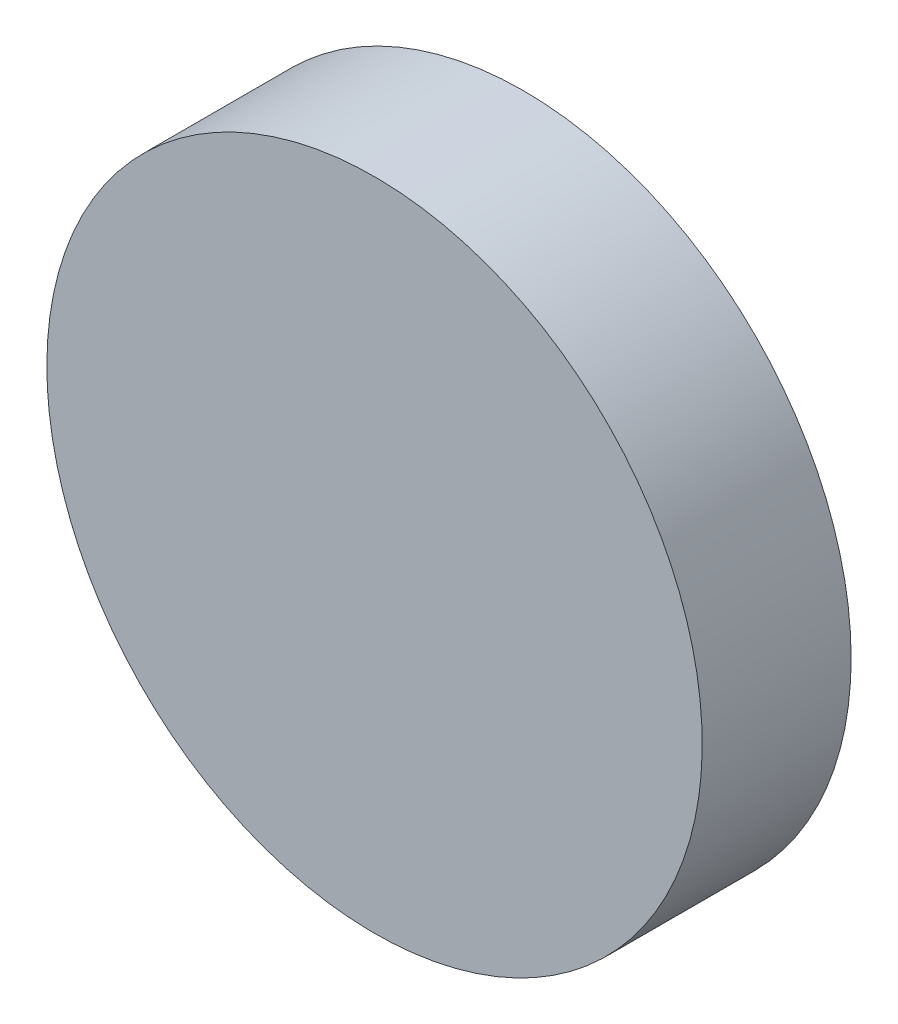
ISO-10303-21;
HEADER;
FILE_DESCRIPTION(('STEP AP214'),'2;1');
FILE_NAME('part.step','',(''),(''),'','','');
FILE_SCHEMA(('AUTOMOTIVE_DESIGN { 1 0 10303 214 1 1 1 1 }'));
ENDSEC;
DATA;
#1=APPLICATION_CONTEXT('core data for automotive mechanical design processes');
#2=APPLICATION_PROTOCOL_DEFINITION('international standard','automotive_design',2000,#1);
#3=PRODUCT_CONTEXT('',#1,'mechanical');
#4=PRODUCT('Part','Part','',(#3));
#5=PRODUCT_RELATED_PRODUCT_CATEGORY('part','',(#4));
#6=PRODUCT_DEFINITION_FORMATION('','',#4);
#7=PRODUCT_DEFINITION_CONTEXT('part definition',#1,'design');
#8=PRODUCT_DEFINITION('design','',#6,#7);
#9=PRODUCT_DEFINITION_SHAPE('','',#8);
#10=(LENGTH_UNIT() NAMED_UNIT(*) SI_UNIT(.MILLI.,.METRE.));
#11=(NAMED_UNIT(*) PLANE_ANGLE_UNIT() SI_UNIT($,.RADIAN.));
#12=(NAMED_UNIT(*) SI_UNIT($,.STERADIAN.) SOLID_ANGLE_UNIT());
#13=UNCERTAINTY_MEASURE_WITH_UNIT(LENGTH_MEASURE(1.E-05),#10,'distance_accuracy_value','');
#14=(GEOMETRIC_REPRESENTATION_CONTEXT(3) GLOBAL_UNCERTAINTY_ASSIGNED_CONTEXT((#13)) GLOBAL_UNIT_ASSIGNED_CONTEXT((#10,
#11,#12)) REPRESENTATION_CONTEXT('',''));
#15=CARTESIAN_POINT('',(0.,0.,0.));
#16=DIRECTION('',(0.,0.,1.));
#17=DIRECTION('',(1.,0.,0.));
#18=AXIS2_PLACEMENT_3D('',#15,#16,#17);
#19=CARTESIAN_POINT('',(-26.0710674761699,-4.71707895126206,257.4992));
#20=CARTESIAN_POINT('',(-26.0710674761699,-3.99696507585602,257.4992));
#21=CARTESIAN_POINT('',(-25.9292174238385,-2.55673732504394,257.4992));
#22=CARTESIAN_POINT('',(-25.2990690152882,-0.479416415987846,257.4992));
#23=CARTESIAN_POINT('',(-24.2757635266339,1.43505349834619,257.4992));
#24=CARTESIAN_POINT('',(-22.8986260139283,3.11310041279741,257.4992));
#25=CARTESIAN_POINT('',(-21.2205790994771,4.490237925503,257.4992));
#26=CARTESIAN_POINT('',(-19.306109185143,5.5135434141573,257.4992));
#27=CARTESIAN_POINT('',(-17.2287882760869,6.14369182270765,257.4992));
#28=CARTESIAN_POINT('',(-15.0684466498688,6.35646690120477,257.4992));
#29=CARTESIAN_POINT('',(-12.9081050236507,6.14369182270765,257.4992));
#30=CARTESIAN_POINT('',(-10.8307841145946,5.5135434141573,257.4992));
#31=CARTESIAN_POINT('',(-8.91631420026057,4.490237925503,257.4992));
#32=CARTESIAN_POINT('',(-7.23826728580934,3.11310041279741,257.4992));
#33=CARTESIAN_POINT('',(-5.86112977310376,1.43505349834619,257.4992));
#34=CARTESIAN_POINT('',(-4.83782428444946,-0.479416415987844,257.4992));
#35=CARTESIAN_POINT('',(-4.20767587589911,-2.55673732504394,257.4992));
#36=CARTESIAN_POINT('',(-3.99490079740198,-4.71707895126205,257.4992));
#37=CARTESIAN_POINT('',(-4.20767587589911,-6.87742057748017,257.4992));
#38=CARTESIAN_POINT('',(-4.83782428444946,-8.95474148653627,257.4992));
#39=CARTESIAN_POINT('',(-5.86112977310376,-10.8692114008703,257.4992));
#40=CARTESIAN_POINT('',(-7.23826728580935,-12.5472583153215,257.4992));
#41=CARTESIAN_POINT('',(-8.91631420026057,-13.9243958280271,257.4992));
#42=CARTESIAN_POINT('',(-10.8307841145946,-14.9477013166814,257.4992));
#43=CARTESIAN_POINT('',(-12.9081050236507,-15.5778497252318,257.4992));
#44=CARTESIAN_POINT('',(-15.0684466498688,-15.7906248037289,257.4992));
#45=CARTESIAN_POINT('',(-17.2287882760869,-15.5778497252318,257.4992));
#46=CARTESIAN_POINT('',(-19.306109185143,-14.9477013166814,257.4992));
#47=CARTESIAN_POINT('',(-21.2205790994771,-13.9243958280271,257.4992));
#48=CARTESIAN_POINT('',(-22.8986260139283,-12.5472583153215,257.4992));
#49=CARTESIAN_POINT('',(-24.2757635266339,-10.8692114008703,257.4992));
#50=CARTESIAN_POINT('',(-25.2990690152882,-8.95474148653627,257.4992));
#51=CARTESIAN_POINT('',(-25.9292174238385,-6.87742057748017,257.4992));
#52=CARTESIAN_POINT('',(-26.0710674761699,-5.43719282666809,257.4992));
#53=CARTESIAN_POINT('',(-26.0710674761699,-4.71707895126206,257.4992));
#54=B_SPLINE_CURVE_WITH_KNOTS('',3,(#19,#20,#21,#22,#23,#24,#25,#26,#27,#28,#29,#30,#31,#32,#33,
#34,#35,#36,#37,#38,#39,#40,#41,#42,#43,#44,#45,#46,#47,#48,#49,#50,#51,#52,#53),.UNSPECIFIED.,
.T.,.F.,(4,1,1,1,1,1,1,1,1,1,1,1,1,1,1,1,1,1,1,1,1,1,1,1,1,1,1,1,1,1,1,1,4),(0.,0.03125,0.0625,
0.09375,0.125,0.15625,0.1875,0.21875,0.25,0.28125,0.3125,0.34375,0.375,0.40625,0.4375,0.46875,
0.5,0.53125,0.5625,0.59375,0.625,0.65625,0.6875,0.71875,0.75,0.78125,0.8125,0.84375,0.875,
0.90625,0.9375,0.96875,1.),.UNSPECIFIED.);
#55=DIRECTION('',(0.,0.,1.));
#56=VECTOR('',#55,1.);
#57=SURFACE_OF_LINEAR_EXTRUSION('',#54,#56);
#58=CARTESIAN_POINT('',(-26.0710674761699,-4.71707895126206,257.4992));
#59=CARTESIAN_POINT('',(-26.0710674388279,-4.8971085255535,257.4992));
#60=CARTESIAN_POINT('',(-26.0666346090958,-5.0771367896126,257.4992));
#61=CARTESIAN_POINT('',(-26.0489459773709,-5.43676092320657,257.4992));
#62=CARTESIAN_POINT('',(-26.0356901068426,-5.61635678937178,257.4992));
#63=CARTESIAN_POINT('',(-26.0003980073713,-5.97468354282203,257.4992));
#64=CARTESIAN_POINT('',(-25.9783617784283,-6.15341443010706,257.4992));
#65=CARTESIAN_POINT('',(-25.9255512820031,-6.50957974007257,257.4992));
#66=CARTESIAN_POINT('',(-25.8947770823977,-6.68701417281297,257.4992));
#67=CARTESIAN_POINT('',(-25.8245333219282,-7.04015340976002,257.4992));
#68=CARTESIAN_POINT('',(-25.7850637610641,-7.21585821396667,257.4992));
#69=CARTESIAN_POINT('',(-25.6975557247985,-7.56512178142148,257.4992));
#70=CARTESIAN_POINT('',(-25.649517182837,-7.73868052798882,257.4992));
#71=CARTESIAN_POINT('',(-25.5449971558665,-8.08323688136578,257.4992));
#72=CARTESIAN_POINT('',(-25.4885156708574,-8.2542344881754,257.4992));
#73=CARTESIAN_POINT('',(-25.3672355012206,-8.59325339294242,257.4992));
#74=CARTESIAN_POINT('',(-25.3024368812029,-8.76127471400897,257.4992));
#75=CARTESIAN_POINT('',(-25.1646487893388,-9.09392459415621,257.4992));
#76=CARTESIAN_POINT('',(-25.0916593174924,-9.25855315323691,257.4992));
#77=CARTESIAN_POINT('',(-24.9376947812545,-9.58403375022228,257.4992));
#78=CARTESIAN_POINT('',(-24.8567196548362,-9.74488575878143,257.4992));
#79=CARTESIAN_POINT('',(-24.6869883410794,-10.0624307121833,257.4992));
#80=CARTESIAN_POINT('',(-24.5982321537408,-10.2191236570259,257.4992));
#81=CARTESIAN_POINT('',(-24.4131430412192,-10.5279678213962,257.4992));
#82=CARTESIAN_POINT('',(-24.3168101748963,-10.6801190761936,257.4992));
#83=CARTESIAN_POINT('',(-24.1167728703543,-10.9794960589194,257.4992));
#84=CARTESIAN_POINT('',(-24.0130684321354,-11.1267217868476,257.4992));
#85=CARTESIAN_POINT('',(-23.7985641668106,-11.4159113744844,257.4992));
#86=CARTESIAN_POINT('',(-23.6877642845949,-11.5578751933105,257.4992));
#87=CARTESIAN_POINT('',(-23.4593443632257,-11.8362056728135,257.4992));
#88=CARTESIAN_POINT('',(-23.3417243240721,-11.9725723334904,257.4992));
#89=CARTESIAN_POINT('',(-23.099939139468,-12.2393730492804,257.4992));
#90=CARTESIAN_POINT('',(-22.9757740448659,-12.3698071504687,257.4992));
#91=CARTESIAN_POINT('',(-22.7211748490755,-12.6244063462591,257.4992));
#92=CARTESIAN_POINT('',(-22.5907407478872,-12.7485714408612,257.4992));
#93=CARTESIAN_POINT('',(-22.3239400320972,-12.9903566254653,257.4992));
#94=CARTESIAN_POINT('',(-22.1875733714202,-13.1079766646189,257.4992));
#95=CARTESIAN_POINT('',(-21.9092428919172,-13.3363965859882,257.4992));
#96=CARTESIAN_POINT('',(-21.7672790730912,-13.4471964682039,257.4992));
#97=CARTESIAN_POINT('',(-21.4780894854543,-13.6617007335286,257.4992));
#98=CARTESIAN_POINT('',(-21.330863757526,-13.7654051717476,257.4992));
#99=CARTESIAN_POINT('',(-21.0314867748005,-13.9654424762895,257.4992));
#100=CARTESIAN_POINT('',(-20.8793355200033,-14.0617753426125,257.4992));
#101=CARTESIAN_POINT('',(-20.5704913556323,-14.2468644551341,257.4992));
#102=CARTESIAN_POINT('',(-20.4137984107886,-14.3356206424727,257.4992));
#103=CARTESIAN_POINT('',(-20.0962534573896,-14.5053519562294,257.4992));
#104=CARTESIAN_POINT('',(-19.9354014488344,-14.5863270826475,257.4992));
#105=CARTESIAN_POINT('',(-19.6099208518383,-14.740291618886,257.4992));
#106=CARTESIAN_POINT('',(-19.4452922927429,-14.813281090733,257.4992));
#107=CARTESIAN_POINT('',(-19.1126424126358,-14.9510691825951,257.4992));
#108=CARTESIAN_POINT('',(-18.9446210916242,-15.0158678026102,257.4992));
#109=CARTESIAN_POINT('',(-18.6056021867071,-15.1371479722544,257.4992));
#110=CARTESIAN_POINT('',(-18.4346045796926,-15.1936294572735,257.4992));
#111=CARTESIAN_POINT('',(-18.0900482268755,-15.2981494842164,257.4992));
#112=CARTESIAN_POINT('',(-17.9164894810731,-15.3461880261401,257.4992));
#113=CARTESIAN_POINT('',(-17.5672259115286,-15.4336960625089,257.4992));
#114=CARTESIAN_POINT('',(-17.3915211044674,-15.473165623514,257.4992));
#115=CARTESIAN_POINT('',(-17.0383818753191,-15.5434093835985,257.4992));
#116=CARTESIAN_POINT('',(-16.8609474532321,-15.5741835826779,257.4992));
#117=CARTESIAN_POINT('',(-16.5047821141609,-15.6269940805399,257.4992));
#118=CARTESIAN_POINT('',(-16.3260511871165,-15.6490303114456,257.4992));
#119=CARTESIAN_POINT('',(-15.9677245422908,-15.6843224055547,257.4992));
#120=CARTESIAN_POINT('',(-15.7881288245094,-15.6975782687583,257.4992));
#121=CARTESIAN_POINT('',(-15.4285042855249,-15.7152669204948,257.4992));
#122=CARTESIAN_POINT('',(-15.2484754676968,-15.7196997775632,257.4992));
#123=CARTESIAN_POINT('',(-14.8884178320408,-15.7196997775632,257.4992));
#124=CARTESIAN_POINT('',(-14.7083890142127,-15.7152669204948,257.4992));
#125=CARTESIAN_POINT('',(-14.3487644752282,-15.6975782687583,257.4992));
#126=CARTESIAN_POINT('',(-14.1691687574468,-15.6843224055547,257.4992));
#127=CARTESIAN_POINT('',(-13.8108421126211,-15.6490303114456,257.4992));
#128=CARTESIAN_POINT('',(-13.6321111855767,-15.6269940805399,257.4992));
#129=CARTESIAN_POINT('',(-13.2759458465055,-15.5741835826779,257.4992));
#130=CARTESIAN_POINT('',(-13.0985114244185,-15.5434093835985,257.4992));
#131=CARTESIAN_POINT('',(-12.7453721952702,-15.473165623514,257.4992));
#132=CARTESIAN_POINT('',(-12.569667388209,-15.4336960625089,257.4992));
#133=CARTESIAN_POINT('',(-12.2204038186645,-15.3461880261401,257.4992));
#134=CARTESIAN_POINT('',(-12.0468450728621,-15.2981494842164,257.4992));
#135=CARTESIAN_POINT('',(-11.7022887200451,-15.1936294572735,257.4992));
#136=CARTESIAN_POINT('',(-11.5312911130305,-15.1371479722544,257.4992));
#137=CARTESIAN_POINT('',(-11.1922722081134,-15.0158678026102,257.4992));
#138=CARTESIAN_POINT('',(-11.0242508871018,-14.9510691825951,257.4992));
#139=CARTESIAN_POINT('',(-10.6916010069948,-14.813281090733,257.4992));
#140=CARTESIAN_POINT('',(-10.5269724478993,-14.7402916188859,257.4992));
#141=CARTESIAN_POINT('',(-10.2014918509032,-14.5863270826475,257.4992));
#142=CARTESIAN_POINT('',(-10.040639842348,-14.5053519562294,257.4992));
#143=CARTESIAN_POINT('',(-9.72309488894904,-14.3356206424727,257.4992));
#144=CARTESIAN_POINT('',(-9.56640194410531,-14.2468644551341,257.4992));
#145=CARTESIAN_POINT('',(-9.25755777973429,-14.0617753426124,257.4992));
#146=CARTESIAN_POINT('',(-9.10540652493712,-13.9654424762895,257.4992));
#147=CARTESIAN_POINT('',(-8.80602954221161,-13.7654051717476,257.4992));
#148=CARTESIAN_POINT('',(-8.65880381428327,-13.6617007335286,257.4992));
#149=CARTESIAN_POINT('',(-8.36961422664641,-13.4471964682039,257.4992));
#150=CARTESIAN_POINT('',(-8.22765040782037,-13.3363965859882,257.4992));
#151=CARTESIAN_POINT('',(-7.94931992831738,-13.1079766646189,257.4992));
#152=CARTESIAN_POINT('',(-7.81295326764042,-12.9903566254653,257.4992));
#153=CARTESIAN_POINT('',(-7.54615255185041,-12.7485714408612,257.4992));
#154=CARTESIAN_POINT('',(-7.41571845066214,-12.6244063462591,257.4992));
#155=CARTESIAN_POINT('',(-7.16111925487175,-12.3698071504687,257.4992));
#156=CARTESIAN_POINT('',(-7.03695416026962,-12.2393730492804,257.4992));
#157=CARTESIAN_POINT('',(-6.79516897566555,-11.9725723334904,257.4992));
#158=CARTESIAN_POINT('',(-6.67754893651195,-11.8362056728135,257.4992));
#159=CARTESIAN_POINT('',(-6.44912901514268,-11.5578751933105,257.4992));
#160=CARTESIAN_POINT('',(-6.33832913292699,-11.4159113744844,257.4992));
#161=CARTESIAN_POINT('',(-6.12382486760225,-11.1267217868476,257.4992));
#162=CARTESIAN_POINT('',(-6.02012042938326,-10.9794960589192,257.4992));
#163=CARTESIAN_POINT('',(-5.82008312484134,-10.6801190761937,257.4992));
#164=CARTESIAN_POINT('',(-5.7237502585184,-10.5279678213966,257.4992));
#165=CARTESIAN_POINT('',(-5.53866114599676,-10.2191236570255,257.4992));
#166=CARTESIAN_POINT('',(-5.44990495865819,-10.0624307121818,257.4992));
#167=CARTESIAN_POINT('',(-5.28017364490149,-9.74488575878287,257.4992));
#168=CARTESIAN_POINT('',(-5.19919851848334,-9.58403375022766,257.4992));
#169=CARTESIAN_POINT('',(-5.04523398224491,-9.25855315323151,257.4992));
#170=CARTESIAN_POINT('',(-4.97224451039784,-9.0939245941361,257.4992));
#171=CARTESIAN_POINT('',(-4.83445641853572,-8.76127471402906,257.4992));
#172=CARTESIAN_POINT('',(-4.76965779852067,-8.59325339301743,257.4992));
#173=CARTESIAN_POINT('',(-4.64837762887649,-8.25423448810037,257.4992));
#174=CARTESIAN_POINT('',(-4.59189614385733,-8.0832368810858,257.4992));
#175=CARTESIAN_POINT('',(-4.48737611691445,-7.73868052826877,257.4992));
#176=CARTESIAN_POINT('',(-4.43933757499072,-7.56512178246632,257.4992));
#177=CARTESIAN_POINT('',(-4.35182953862194,-7.21585821292182,257.4992));
#178=CARTESIAN_POINT('',(-4.3123599776169,-7.04015340586061,257.4992));
#179=CARTESIAN_POINT('',(-4.24211621753239,-6.68701417671236,257.4992));
#180=CARTESIAN_POINT('',(-4.21134201845292,-6.50957975462531,257.4992));
#181=CARTESIAN_POINT('',(-4.15853152059092,-6.15341441555418,257.4992));
#182=CARTESIAN_POINT('',(-4.13649528968527,-5.97468348850978,257.4992));
#183=CARTESIAN_POINT('',(-4.10120319557612,-5.616356843684,257.4992));
#184=CARTESIAN_POINT('',(-4.08794733237261,-5.43676112590262,257.4992));
#185=CARTESIAN_POINT('',(-4.07025868063606,-5.0771365869181,257.4992));
#186=CARTESIAN_POINT('',(-4.06582582356769,-4.89710776909007,257.4992));
#187=CARTESIAN_POINT('',(-4.06582582356769,-4.53705013343401,257.4992));
#188=CARTESIAN_POINT('',(-4.07025868063606,-4.35702131560598,257.4992));
#189=CARTESIAN_POINT('',(-4.08794733237261,-3.99739677662146,257.4992));
#190=CARTESIAN_POINT('',(-4.10120319557612,-3.81780105884008,257.4992));
#191=CARTESIAN_POINT('',(-4.13649528968528,-3.4594744140143,257.4992));
#192=CARTESIAN_POINT('',(-4.15853152059093,-3.28074348696989,257.4992));
#193=CARTESIAN_POINT('',(-4.21134201845293,-2.92457814789877,257.4992));
#194=CARTESIAN_POINT('',(-4.24211621753239,-2.74714372581172,257.4992));
#195=CARTESIAN_POINT('',(-4.3123599776169,-2.39400449666347,257.4992));
#196=CARTESIAN_POINT('',(-4.35182953862194,-2.21829968960226,257.4992));
#197=CARTESIAN_POINT('',(-4.43933757499072,-1.86903612005776,257.4992));
#198=CARTESIAN_POINT('',(-4.48737611691445,-1.69547737425531,257.4992));
#199=CARTESIAN_POINT('',(-4.59189614385734,-1.35092102143828,257.4992));
#200=CARTESIAN_POINT('',(-4.6483776288765,-1.17992341442371,257.4992));
#201=CARTESIAN_POINT('',(-4.76965779852068,-0.840904509506655,257.4992));
#202=CARTESIAN_POINT('',(-4.83445641853573,-0.672883188495029,257.4992));
#203=CARTESIAN_POINT('',(-4.97224451039785,-0.340233308387991,257.4992));
#204=CARTESIAN_POINT('',(-5.04523398224492,-0.175604749292578,257.4992));
#205=CARTESIAN_POINT('',(-5.19919851848335,0.14987584770357,257.4992));
#206=CARTESIAN_POINT('',(-5.2801736449015,0.310727856258778,257.4992));
#207=CARTESIAN_POINT('',(-5.44990495865821,0.628272809657717,257.4992));
#208=CARTESIAN_POINT('',(-5.53866114599677,0.784965754501448,257.4992));
#209=CARTESIAN_POINT('',(-5.72375025851842,1.09380991887247,257.4992));
#210=CARTESIAN_POINT('',(-5.82008312484135,1.24596117366964,257.4992));
#211=CARTESIAN_POINT('',(-6.02012042938328,1.54533815639515,257.4992));
#212=CARTESIAN_POINT('',(-6.12382486760227,1.6925638843235,257.4992));
#213=CARTESIAN_POINT('',(-6.33832913292701,1.98175347196035,257.4992));
#214=CARTESIAN_POINT('',(-6.44912901514269,2.12371729078638,257.4992));
#215=CARTESIAN_POINT('',(-6.67754893651197,2.40204777028938,257.4992));
#216=CARTESIAN_POINT('',(-6.79516897566556,2.53841443096634,257.4992));
#217=CARTESIAN_POINT('',(-7.03695416026964,2.80521514675634,257.4992));
#218=CARTESIAN_POINT('',(-7.16111925487176,2.93564924794461,257.4992));
#219=CARTESIAN_POINT('',(-7.41571845066216,3.19024844373501,257.4992));
#220=CARTESIAN_POINT('',(-7.54615255185043,3.31441353833713,257.4992));
#221=CARTESIAN_POINT('',(-7.81295326764043,3.55619872294121,257.4992));
#222=CARTESIAN_POINT('',(-7.9493199283174,3.6738187620948,257.4992));
#223=CARTESIAN_POINT('',(-8.22765040782039,3.90223868346408,257.4992));
#224=CARTESIAN_POINT('',(-8.36961422664642,4.01303856567976,257.4992));
#225=CARTESIAN_POINT('',(-8.65880381428328,4.2275428310045,257.4992));
#226=CARTESIAN_POINT('',(-8.80602954221162,4.33124726922349,257.4992));
#227=CARTESIAN_POINT('',(-9.10540652493714,4.53128457376542,257.4992));
#228=CARTESIAN_POINT('',(-9.25755777973431,4.62761744008835,257.4992));
#229=CARTESIAN_POINT('',(-9.56640194410533,4.81270655261,257.4992));
#230=CARTESIAN_POINT('',(-9.72309488894906,4.90146273994857,257.4992));
#231=CARTESIAN_POINT('',(-10.040639842348,5.07119405370527,257.4992));
#232=CARTESIAN_POINT('',(-10.2014918509032,5.15216918012342,257.4992));
#233=CARTESIAN_POINT('',(-10.5269724478994,5.30613371636185,257.4992));
#234=CARTESIAN_POINT('',(-10.6916010069948,5.37912318820892,257.4992));
#235=CARTESIAN_POINT('',(-11.0242508871018,5.51691128007104,257.4992));
#236=CARTESIAN_POINT('',(-11.1922722081134,5.58170990008609,257.4992));
#237=CARTESIAN_POINT('',(-11.5312911130305,5.70299006973027,257.4992));
#238=CARTESIAN_POINT('',(-11.7022887200451,5.75947155474943,257.4992));
#239=CARTESIAN_POINT('',(-12.0468450728621,5.86399158169231,257.4992));
#240=CARTESIAN_POINT('',(-12.2204038186645,5.91203012361604,257.4992));
#241=CARTESIAN_POINT('',(-12.569667388209,5.99953815998482,257.4992));
#242=CARTESIAN_POINT('',(-12.7453721952702,6.03900772098986,257.4992));
#243=CARTESIAN_POINT('',(-13.0985114244185,6.10925148107437,257.4992));
#244=CARTESIAN_POINT('',(-13.2759458465055,6.14002568015384,257.4992));
#245=CARTESIAN_POINT('',(-13.6321111855767,6.19283617801583,257.4992));
#246=CARTESIAN_POINT('',(-13.8108421126211,6.21487240892148,257.4992));
#247=CARTESIAN_POINT('',(-14.1691687574469,6.25016450303064,257.4992));
#248=CARTESIAN_POINT('',(-14.3487644752282,6.26342036623415,257.4992));
#249=CARTESIAN_POINT('',(-14.7083890142128,6.2811090179707,257.4992));
#250=CARTESIAN_POINT('',(-14.8884178320408,6.28554187503907,257.4992));
#251=CARTESIAN_POINT('',(-15.2484754676969,6.28554187503907,257.4992));
#252=CARTESIAN_POINT('',(-15.4285042855249,6.2811090179707,257.4992));
#253=CARTESIAN_POINT('',(-15.7881288245094,6.26342036623415,257.4992));
#254=CARTESIAN_POINT('',(-15.9677245422908,6.25016450303063,257.4992));
#255=CARTESIAN_POINT('',(-16.3260511871166,6.21487240892148,257.4992));
#256=CARTESIAN_POINT('',(-16.504782114161,6.19283617801583,257.4992));
#257=CARTESIAN_POINT('',(-16.8609474532321,6.14002568015383,257.4992));
#258=CARTESIAN_POINT('',(-17.0383818753191,6.10925148107436,257.4992));
#259=CARTESIAN_POINT('',(-17.3915211044674,6.03900772098986,257.4992));
#260=CARTESIAN_POINT('',(-17.5672259115286,5.99953815998482,257.4992));
#261=CARTESIAN_POINT('',(-17.9164894810731,5.91203012361604,257.4992));
#262=CARTESIAN_POINT('',(-18.0900482268755,5.86399158169231,257.4992));
#263=CARTESIAN_POINT('',(-18.4346045796926,5.75947155474942,257.4992));
#264=CARTESIAN_POINT('',(-18.6056021867071,5.70299006973026,257.4992));
#265=CARTESIAN_POINT('',(-18.9446210916242,5.58170990008608,257.4992));
#266=CARTESIAN_POINT('',(-19.1126424126358,5.51691128007103,257.4992));
#267=CARTESIAN_POINT('',(-19.4452922927429,5.37912318820891,257.4992));
#268=CARTESIAN_POINT('',(-19.6099208518383,5.30613371636184,257.4992));
#269=CARTESIAN_POINT('',(-19.9354014488344,5.15216918012341,257.4992));
#270=CARTESIAN_POINT('',(-20.0962534573896,5.07119405370527,257.4992));
#271=CARTESIAN_POINT('',(-20.4137984107886,4.90146273994856,257.4992));
#272=CARTESIAN_POINT('',(-20.5704913556323,4.81270655260999,257.4992));
#273=CARTESIAN_POINT('',(-20.8793355200033,4.62761744008834,257.4992));
#274=CARTESIAN_POINT('',(-21.0314867748005,4.53128457376541,257.4992));
#275=CARTESIAN_POINT('',(-21.330863757526,4.33124726922348,257.4992));
#276=CARTESIAN_POINT('',(-21.4780894854544,4.22754283100449,257.4992));
#277=CARTESIAN_POINT('',(-21.7672790730912,4.01303856567975,257.4992));
#278=CARTESIAN_POINT('',(-21.9092428919172,3.90223868346407,257.4992));
#279=CARTESIAN_POINT('',(-22.1875733714202,3.67381876209479,257.4992));
#280=CARTESIAN_POINT('',(-22.3239400320972,3.5561987229412,257.4992));
#281=CARTESIAN_POINT('',(-22.5907407478872,3.31441353833712,257.4992));
#282=CARTESIAN_POINT('',(-22.7211748490755,3.190248443735,257.4992));
#283=CARTESIAN_POINT('',(-22.9757740448659,2.9356492479446,257.4992));
#284=CARTESIAN_POINT('',(-23.099939139468,2.80521514675633,257.4992));
#285=CARTESIAN_POINT('',(-23.3417243240721,2.53841443096633,257.4992));
#286=CARTESIAN_POINT('',(-23.4593443632257,2.40204777028937,257.4992));
#287=CARTESIAN_POINT('',(-23.6877642845949,2.12371729078637,257.4992));
#288=CARTESIAN_POINT('',(-23.7985641668106,1.98175347196032,257.4992));
#289=CARTESIAN_POINT('',(-24.0130684321354,1.69256388432351,257.4992));
#290=CARTESIAN_POINT('',(-24.1167728703543,1.54533815639525,257.4992));
#291=CARTESIAN_POINT('',(-24.3168101748963,1.24596117366952,257.4992));
#292=CARTESIAN_POINT('',(-24.4131430412192,1.09380991887207,257.4992));
#293=CARTESIAN_POINT('',(-24.5982321537408,0.784965754501822,257.4992));
#294=CARTESIAN_POINT('',(-24.6869883410793,0.628272809659148,257.4992));
#295=CARTESIAN_POINT('',(-24.8567196548362,0.310727856257323,257.4992));
#296=CARTESIAN_POINT('',(-24.9376947812545,0.149875847698171,257.4992));
#297=CARTESIAN_POINT('',(-25.0916593174924,-0.175604749287205,257.4992));
#298=CARTESIAN_POINT('',(-25.1646487893388,-0.340233308367904,257.4992));
#299=CARTESIAN_POINT('',(-25.3024368812029,-0.672883188515144,257.4992));
#300=CARTESIAN_POINT('',(-25.3672355012206,-0.840904509581686,257.4992));
#301=CARTESIAN_POINT('',(-25.4885156708574,-1.17992341434871,257.4992));
#302=CARTESIAN_POINT('',(-25.5449971558665,-1.35092102115833,257.4992));
#303=CARTESIAN_POINT('',(-25.649517182837,-1.69547737453529,257.4992));
#304=CARTESIAN_POINT('',(-25.6975557247985,-1.86903612110263,257.4992));
#305=CARTESIAN_POINT('',(-25.7850637610641,-2.21829968855743,257.4992));
#306=CARTESIAN_POINT('',(-25.8245333219282,-2.39400449276409,257.4992));
#307=CARTESIAN_POINT('',(-25.8947770823977,-2.74714372971114,257.4992));
#308=CARTESIAN_POINT('',(-25.9255512820031,-2.92457816245154,257.4992));
#309=CARTESIAN_POINT('',(-25.9783617784283,-3.28074347241705,257.4992));
#310=CARTESIAN_POINT('',(-26.0003980073713,-3.45947435970208,257.4992));
#311=CARTESIAN_POINT('',(-26.0356901068426,-3.81780111315233,257.4992));
#312=CARTESIAN_POINT('',(-26.0489459773709,-3.99739697931754,257.4992));
#313=CARTESIAN_POINT('',(-26.0666346090958,-4.35702111291151,257.4992));
#314=CARTESIAN_POINT('',(-26.0710674388279,-4.53704937697061,257.4992));
#315=CARTESIAN_POINT('',(-26.0710674761699,-4.71707895126206,257.4992));
#316=B_SPLINE_CURVE_WITH_KNOTS('',3,(#58,#59,#60,#61,#62,#63,#64,#65,#66,#67,#68,#69,#70,#71,
#72,#73,#74,#75,#76,#77,#78,#79,#80,#81,#82,#83,#84,#85,#86,#87,#88,#89,#90,#91,#92,#93,#94,#95,
#96,#97,#98,#99,#100,#101,#102,#103,#104,#105,#106,#107,#108,#109,#110,#111,#112,#113,#114,#115,
#116,#117,#118,#119,#120,#121,#122,#123,#124,#125,#126,#127,#128,#129,#130,#131,#132,#133,#134,
#135,#136,#137,#138,#139,#140,#141,#142,#143,#144,#145,#146,#147,#148,#149,#150,#151,#152,#153,
#154,#155,#156,#157,#158,#159,#160,#161,#162,#163,#164,#165,#166,#167,#168,#169,#170,#171,#172,
#173,#174,#175,#176,#177,#178,#179,#180,#181,#182,#183,#184,#185,#186,#187,#188,#189,#190,#191,
#192,#193,#194,#195,#196,#197,#198,#199,#200,#201,#202,#203,#204,#205,#206,#207,#208,#209,#210,
#211,#212,#213,#214,#215,#216,#217,#218,#219,#220,#221,#222,#223,#224,#225,#226,#227,#228,#229,
#230,#231,#232,#233,#234,#235,#236,#237,#238,#239,#240,#241,#242,#243,#244,#245,#246,#247,#248,
#249,#250,#251,#252,#253,#254,#255,#256,#257,#258,#259,#260,#261,#262,#263,#264,#265,#266,#267,
#268,#269,#270,#271,#272,#273,#274,#275,#276,#277,#278,#279,#280,#281,#282,#283,#284,#285,#286,
#287,#288,#289,#290,#291,#292,#293,#294,#295,#296,#297,#298,#299,#300,#301,#302,#303,#304,#305,
#306,#307,#308,#309,#310,#311,#312,#313,#314,#315),.UNSPECIFIED.,.F.,.F.,(4,2,2,2,2,2,2,2,2,2,2,
2,2,2,2,2,2,2,2,2,2,2,2,2,2,2,2,2,2,2,2,2,2,2,2,2,2,2,2,2,2,2,2,2,2,2,2,2,2,2,2,2,2,2,2,2,2,2,2,
2,2,2,2,2,2,2,2,2,2,2,2,2,2,2,2,2,2,2,2,2,2,2,2,2,2,2,2,2,2,2,2,2,2,2,2,2,2,2,2,2,2,2,2,2,2,2,2,
2,2,2,2,2,2,2,2,2,2,2,2,2,2,2,2,2,2,2,2,2,4),(0.,0.54003244633384,1.0800690875792,
1.62010572882456,2.1601381751584,2.70017062149224,3.2402072627376,3.78024390398297,
4.3202763503168,4.86030879665065,5.40034543789601,5.94038207914137,6.48041452547521,
7.02044697180905,7.56048361305441,8.10052025429978,8.64055270063362,9.18058514696746,
9.72062178821283,10.2606584294582,10.800690875792,11.3407233221259,11.8807599633712,
12.4207966046166,12.9608290509504,13.5008614972843,14.0408981385296,14.580934779775,
15.1209672261088,15.6609996724427,16.201036313688,16.7410729549334,17.2811054012673,
17.8211378476011,18.3611744888465,18.9012111300918,19.4412435764256,19.9812760227595,
20.5213126640048,21.0613493052502,21.6013817515841,22.1414141979179,22.6814508391633,
23.2214874804086,23.7615199267425,24.3015523730763,24.8415890143217,25.381625655567,
25.9216581019009,26.4616905482347,27.0017271894801,27.5417638307254,28.0817962770593,
28.6218287233931,29.1618653646385,29.7019020058838,30.2419344522177,30.7819668985515,
31.3220035397969,31.8620401810422,32.4020726273761,32.9421050737099,33.4821417149553,
34.0221783562007,34.5622108025345,35.1022432488683,35.6422798901137,36.1823165313591,
36.7223489776929,37.2623814240267,37.8024180652721,38.3424547065175,38.8824871528513,
39.4225195991851,39.9625562404305,40.5025928816759,41.0426253280097,41.5826577743435,
42.1226944155889,42.6627310568343,43.2027635031681,43.7427959495019,44.2828325907473,
44.8228692319927,45.3629016783265,45.9029341246604,46.4429707659057,46.9830074071511,
47.5230398534849,48.0630722998188,48.6031089410641,49.1431455823095,49.6831780286433,
50.2232104749772,50.7632471162225,51.3032837574679,51.8433162038017,52.3833486501356,
52.9233852913809,53.4634219326263,54.0034543789601,54.543486825294,55.0835234665393,
55.6235601077847,56.1635925541185,56.7036250004524,57.2436616416977,57.7836982829431,
58.3237307292769,58.8637631756108,59.4037998168561,59.9438364581015,60.4838689044353,
61.0239013507692,61.5639379920145,62.1039746332599,62.6440070795937,63.1840395259276,
63.7240761671729,64.2641128084183,64.8041452547521,65.344177701086,65.8842143423313,
66.4242509835767,66.9642834299105,67.5043158762444,68.0443525174897,68.5843891587351,
69.1244216050689),.UNSPECIFIED.);
#317=CARTESIAN_POINT('',(-26.0710674761699,-4.71707895126206,257.4992));
#318=VERTEX_POINT('',#317);
#319=EDGE_CURVE('E10',#318,#318,#316,.F.);
#320=ORIENTED_EDGE('',*,*,#319,.F.);
#321=EDGE_LOOP('',(#320));
#322=FACE_BOUND('',#321,.T.);
#323=CARTESIAN_POINT('',(-26.0710674761699,-4.71707895126206,262.4992));
#324=CARTESIAN_POINT('',(-26.0710674761699,-3.99696507585602,262.4992));
#325=CARTESIAN_POINT('',(-25.9292174238385,-2.55673732504394,262.4992));
#326=CARTESIAN_POINT('',(-25.2990690152882,-0.479416415987846,262.4992));
#327=CARTESIAN_POINT('',(-24.2757635266339,1.43505349834619,262.4992));
#328=CARTESIAN_POINT('',(-22.8986260139283,3.11310041279741,262.4992));
#329=CARTESIAN_POINT('',(-21.2205790994771,4.490237925503,262.4992));
#330=CARTESIAN_POINT('',(-19.306109185143,5.5135434141573,262.4992));
#331=CARTESIAN_POINT('',(-17.2287882760869,6.14369182270765,262.4992));
#332=CARTESIAN_POINT('',(-15.0684466498688,6.35646690120477,262.4992));
#333=CARTESIAN_POINT('',(-12.9081050236507,6.14369182270765,262.4992));
#334=CARTESIAN_POINT('',(-10.8307841145946,5.5135434141573,262.4992));
#335=CARTESIAN_POINT('',(-8.91631420026057,4.490237925503,262.4992));
#336=CARTESIAN_POINT('',(-7.23826728580934,3.11310041279741,262.4992));
#337=CARTESIAN_POINT('',(-5.86112977310376,1.43505349834619,262.4992));
#338=CARTESIAN_POINT('',(-4.83782428444946,-0.479416415987844,262.4992));
#339=CARTESIAN_POINT('',(-4.20767587589911,-2.55673732504394,262.4992));
#340=CARTESIAN_POINT('',(-3.99490079740198,-4.71707895126205,262.4992));
#341=CARTESIAN_POINT('',(-4.20767587589911,-6.87742057748017,262.4992));
#342=CARTESIAN_POINT('',(-4.83782428444946,-8.95474148653627,262.4992));
#343=CARTESIAN_POINT('',(-5.86112977310376,-10.8692114008703,262.4992));
#344=CARTESIAN_POINT('',(-7.23826728580935,-12.5472583153215,262.4992));
#345=CARTESIAN_POINT('',(-8.91631420026057,-13.9243958280271,262.4992));
#346=CARTESIAN_POINT('',(-10.8307841145946,-14.9477013166814,262.4992));
#347=CARTESIAN_POINT('',(-12.9081050236507,-15.5778497252318,262.4992));
#348=CARTESIAN_POINT('',(-15.0684466498688,-15.7906248037289,262.4992));
#349=CARTESIAN_POINT('',(-17.2287882760869,-15.5778497252318,262.4992));
#350=CARTESIAN_POINT('',(-19.306109185143,-14.9477013166814,262.4992));
#351=CARTESIAN_POINT('',(-21.2205790994771,-13.9243958280271,262.4992));
#352=CARTESIAN_POINT('',(-22.8986260139283,-12.5472583153215,262.4992));
#353=CARTESIAN_POINT('',(-24.2757635266339,-10.8692114008703,262.4992));
#354=CARTESIAN_POINT('',(-25.2990690152882,-8.95474148653627,262.4992));
#355=CARTESIAN_POINT('',(-25.9292174238385,-6.87742057748017,262.4992));
#356=CARTESIAN_POINT('',(-26.0710674761699,-5.43719282666809,262.4992));
#357=CARTESIAN_POINT('',(-26.0710674761699,-4.71707895126205,262.4992));
#358=B_SPLINE_CURVE_WITH_KNOTS('',3,(#323,#324,#325,#326,#327,#328,#329,#330,#331,#332,#333,
#334,#335,#336,#337,#338,#339,#340,#341,#342,#343,#344,#345,#346,#347,#348,#349,#350,#351,#352,
#353,#354,#355,#356,#357),.UNSPECIFIED.,.T.,.F.,(4,1,1,1,1,1,1,1,1,1,1,1,1,1,1,1,1,1,1,1,1,1,1,
1,1,1,1,1,1,1,1,1,4),(0.,0.03125,0.0625,0.09375,0.125,0.15625,0.1875,0.21875,0.25,0.28125,
0.3125,0.34375,0.375,0.40625,0.4375,0.46875,0.5,0.53125,0.5625,0.59375,0.625,0.65625,0.6875,
0.71875,0.75,0.78125,0.8125,0.84375,0.875,0.90625,0.9375,0.96875,1.),.UNSPECIFIED.);
#359=CARTESIAN_POINT('',(-26.0710674761699,-4.71707895126206,262.4992));
#360=VERTEX_POINT('',#359);
#361=EDGE_CURVE('E25',#360,#360,#358,.T.);
#362=ORIENTED_EDGE('',*,*,#361,.T.);
#363=EDGE_LOOP('',(#362));
#364=FACE_BOUND('',#363,.T.);
#365=ADVANCED_FACE('F15',(#322,#364),#57,.F.);
#366=CARTESIAN_POINT('',(-25.7684466498688,-4.71707895126205,257.4992));
#367=DIRECTION('',(0.,0.,1.));
#368=DIRECTION('',(0.,-1.,0.));
#369=AXIS2_PLACEMENT_3D('',#366,#367,#368);
#370=PLANE('',#369);
#371=ORIENTED_EDGE('',*,*,#319,.T.);
#372=EDGE_LOOP('',(#371));
#373=FACE_BOUND('',#372,.T.);
#374=ADVANCED_FACE('F60',(#373),#370,.F.);
#375=CARTESIAN_POINT('',(-25.7684466498688,-4.71707895126205,262.4992));
#376=DIRECTION('',(0.,0.,1.));
#377=DIRECTION('',(0.,-1.,0.));
#378=AXIS2_PLACEMENT_3D('',#375,#376,#377);
#379=PLANE('',#378);
#380=ORIENTED_EDGE('',*,*,#361,.F.);
#381=EDGE_LOOP('',(#380));
#382=FACE_BOUND('',#381,.T.);
#383=ADVANCED_FACE('F68',(#382),#379,.T.);
#384=CLOSED_SHELL('',(#365,#374,#383));
#385=MANIFOLD_SOLID_BREP('B1',#384);
#386=ADVANCED_BREP_SHAPE_REPRESENTATION('',(#18,#385),#14);
#387=SHAPE_DEFINITION_REPRESENTATION(#9,#386);
ENDSEC;
END-ISO-10303-21;
